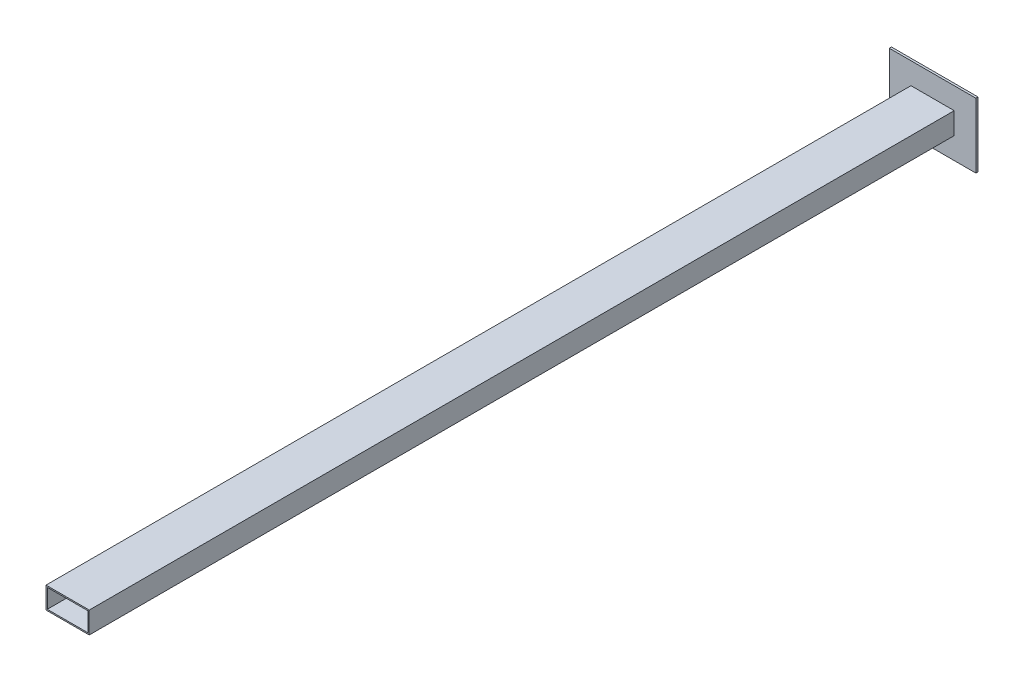
ISO-10303-21;
HEADER;
FILE_DESCRIPTION(('STEP AP214'),'2;1');
FILE_NAME('part.step','',(''),(''),'','','');
FILE_SCHEMA(('AUTOMOTIVE_DESIGN { 1 0 10303 214 1 1 1 1 }'));
ENDSEC;
DATA;
#1=APPLICATION_CONTEXT('core data for automotive mechanical design processes');
#2=APPLICATION_PROTOCOL_DEFINITION('international standard','automotive_design',2000,#1);
#3=PRODUCT_CONTEXT('',#1,'mechanical');
#4=PRODUCT('Part','Part','',(#3));
#5=PRODUCT_RELATED_PRODUCT_CATEGORY('part','',(#4));
#6=PRODUCT_DEFINITION_FORMATION('','',#4);
#7=PRODUCT_DEFINITION_CONTEXT('part definition',#1,'design');
#8=PRODUCT_DEFINITION('design','',#6,#7);
#9=PRODUCT_DEFINITION_SHAPE('','',#8);
#10=(LENGTH_UNIT() NAMED_UNIT(*) SI_UNIT(.MILLI.,.METRE.));
#11=(NAMED_UNIT(*) PLANE_ANGLE_UNIT() SI_UNIT($,.RADIAN.));
#12=(NAMED_UNIT(*) SI_UNIT($,.STERADIAN.) SOLID_ANGLE_UNIT());
#13=UNCERTAINTY_MEASURE_WITH_UNIT(LENGTH_MEASURE(1.E-05),#10,'distance_accuracy_value','');
#14=(GEOMETRIC_REPRESENTATION_CONTEXT(3) GLOBAL_UNCERTAINTY_ASSIGNED_CONTEXT((#13)) GLOBAL_UNIT_ASSIGNED_CONTEXT((#10,
#11,#12)) REPRESENTATION_CONTEXT('',''));
#15=CARTESIAN_POINT('',(0.,0.,0.));
#16=DIRECTION('',(0.,0.,1.));
#17=DIRECTION('',(1.,0.,0.));
#18=AXIS2_PLACEMENT_3D('',#15,#16,#17);
#19=CARTESIAN_POINT('',(0.,0.,0.));
#20=DIRECTION('',(0.,0.,1.));
#21=DIRECTION('',(1.,0.,0.));
#22=AXIS2_PLACEMENT_3D('',#19,#20,#21);
#23=PLANE('',#22);
#24=DIRECTION('',(0.,1.,0.));
#25=VECTOR('',#24,1.);
#26=CARTESIAN_POINT('',(-50.,-50.,0.));
#27=LINE('',#26,#25);
#28=CARTESIAN_POINT('',(-50.,-50.,0.));
#29=VERTEX_POINT('',#28);
#30=CARTESIAN_POINT('',(-50.,100.,0.));
#31=VERTEX_POINT('',#30);
#32=EDGE_CURVE('E130',#29,#31,#27,.T.);
#33=ORIENTED_EDGE('',*,*,#32,.F.);
#34=DIRECTION('',(-1.,0.,0.));
#35=VECTOR('',#34,1.);
#36=CARTESIAN_POINT('',(150.,-50.,0.));
#37=LINE('',#36,#35);
#38=CARTESIAN_POINT('',(150.,-50.,0.));
#39=VERTEX_POINT('',#38);
#40=EDGE_CURVE('E103',#39,#29,#37,.T.);
#41=ORIENTED_EDGE('',*,*,#40,.F.);
#42=DIRECTION('',(0.,-1.,0.));
#43=VECTOR('',#42,1.);
#44=CARTESIAN_POINT('',(150.,-50.,0.));
#45=LINE('',#44,#43);
#46=CARTESIAN_POINT('',(150.,100.,0.));
#47=VERTEX_POINT('',#46);
#48=EDGE_CURVE('E97',#47,#39,#45,.T.);
#49=ORIENTED_EDGE('',*,*,#48,.F.);
#50=DIRECTION('',(1.,0.,0.));
#51=VECTOR('',#50,1.);
#52=CARTESIAN_POINT('',(150.,100.,0.));
#53=LINE('',#52,#51);
#54=EDGE_CURVE('E119',#31,#47,#53,.T.);
#55=ORIENTED_EDGE('',*,*,#54,.F.);
#56=EDGE_LOOP('',(#33,#41,#49,#55));
#57=FACE_BOUND('',#56,.T.);
#58=ADVANCED_FACE('F59',(#57),#23,.T.);
#59=CARTESIAN_POINT('',(150.,100.,-5.));
#60=DIRECTION('',(0.,-1.,0.));
#61=DIRECTION('',(0.,0.,-1.));
#62=AXIS2_PLACEMENT_3D('',#59,#60,#61);
#63=PLANE('',#62);
#64=ORIENTED_EDGE('',*,*,#54,.T.);
#65=DIRECTION('',(0.,0.,1.));
#66=VECTOR('',#65,1.);
#67=CARTESIAN_POINT('',(150.,100.,-5.));
#68=LINE('',#67,#66);
#69=CARTESIAN_POINT('',(150.,100.,-5.));
#70=VERTEX_POINT('',#69);
#71=EDGE_CURVE('E68',#70,#47,#68,.T.);
#72=ORIENTED_EDGE('',*,*,#71,.F.);
#73=DIRECTION('',(1.,0.,0.));
#74=VECTOR('',#73,1.);
#75=CARTESIAN_POINT('',(150.,100.,-5.));
#76=LINE('',#75,#74);
#77=CARTESIAN_POINT('',(-50.,100.,-5.));
#78=VERTEX_POINT('',#77);
#79=EDGE_CURVE('E110',#78,#70,#76,.T.);
#80=ORIENTED_EDGE('',*,*,#79,.F.);
#81=DIRECTION('',(0.,0.,1.));
#82=VECTOR('',#81,1.);
#83=CARTESIAN_POINT('',(-50.,100.,-5.));
#84=LINE('',#83,#82);
#85=EDGE_CURVE('E12',#78,#31,#84,.T.);
#86=ORIENTED_EDGE('',*,*,#85,.T.);
#87=EDGE_LOOP('',(#64,#72,#80,#86));
#88=FACE_BOUND('',#87,.T.);
#89=ADVANCED_FACE('F118',(#88),#63,.F.);
#90=CARTESIAN_POINT('',(150.,-50.,-5.));
#91=DIRECTION('',(-1.,0.,0.));
#92=DIRECTION('',(0.,0.,1.));
#93=AXIS2_PLACEMENT_3D('',#90,#91,#92);
#94=PLANE('',#93);
#95=ORIENTED_EDGE('',*,*,#48,.T.);
#96=DIRECTION('',(0.,0.,1.));
#97=VECTOR('',#96,1.);
#98=CARTESIAN_POINT('',(150.,-50.,-5.));
#99=LINE('',#98,#97);
#100=CARTESIAN_POINT('',(150.,-50.,-5.));
#101=VERTEX_POINT('',#100);
#102=EDGE_CURVE('E120',#101,#39,#99,.T.);
#103=ORIENTED_EDGE('',*,*,#102,.F.);
#104=DIRECTION('',(0.,-1.,0.));
#105=VECTOR('',#104,1.);
#106=CARTESIAN_POINT('',(150.,-50.,-5.));
#107=LINE('',#106,#105);
#108=EDGE_CURVE('E113',#70,#101,#107,.T.);
#109=ORIENTED_EDGE('',*,*,#108,.F.);
#110=ORIENTED_EDGE('',*,*,#71,.T.);
#111=EDGE_LOOP('',(#95,#103,#109,#110));
#112=FACE_BOUND('',#111,.T.);
#113=ADVANCED_FACE('F121',(#112),#94,.F.);
#114=CARTESIAN_POINT('',(0.,0.,-5.));
#115=DIRECTION('',(0.,0.,1.));
#116=DIRECTION('',(1.,0.,0.));
#117=AXIS2_PLACEMENT_3D('',#114,#115,#116);
#118=PLANE('',#117);
#119=DIRECTION('',(0.,1.,0.));
#120=VECTOR('',#119,1.);
#121=CARTESIAN_POINT('',(-50.,-50.,-5.));
#122=LINE('',#121,#120);
#123=CARTESIAN_POINT('',(-50.,-50.,-5.));
#124=VERTEX_POINT('',#123);
#125=EDGE_CURVE('E115',#124,#78,#122,.T.);
#126=ORIENTED_EDGE('',*,*,#125,.T.);
#127=ORIENTED_EDGE('',*,*,#79,.T.);
#128=ORIENTED_EDGE('',*,*,#108,.T.);
#129=DIRECTION('',(-1.,0.,0.));
#130=VECTOR('',#129,1.);
#131=CARTESIAN_POINT('',(150.,-50.,-5.));
#132=LINE('',#131,#130);
#133=EDGE_CURVE('E79',#101,#124,#132,.T.);
#134=ORIENTED_EDGE('',*,*,#133,.T.);
#135=EDGE_LOOP('',(#126,#127,#128,#134));
#136=FACE_BOUND('',#135,.T.);
#137=ADVANCED_FACE('F111',(#136),#118,.F.);
#138=CARTESIAN_POINT('',(-50.,-50.,-5.));
#139=DIRECTION('',(1.,0.,0.));
#140=DIRECTION('',(0.,0.,-1.));
#141=AXIS2_PLACEMENT_3D('',#138,#139,#140);
#142=PLANE('',#141);
#143=ORIENTED_EDGE('',*,*,#32,.T.);
#144=ORIENTED_EDGE('',*,*,#85,.F.);
#145=ORIENTED_EDGE('',*,*,#125,.F.);
#146=DIRECTION('',(0.,0.,1.));
#147=VECTOR('',#146,1.);
#148=CARTESIAN_POINT('',(-50.,-50.,-5.));
#149=LINE('',#148,#147);
#150=EDGE_CURVE('E126',#124,#29,#149,.T.);
#151=ORIENTED_EDGE('',*,*,#150,.T.);
#152=EDGE_LOOP('',(#143,#144,#145,#151));
#153=FACE_BOUND('',#152,.T.);
#154=ADVANCED_FACE('F61',(#153),#142,.F.);
#155=CARTESIAN_POINT('',(150.,-50.,-5.));
#156=DIRECTION('',(0.,1.,0.));
#157=DIRECTION('',(0.,0.,1.));
#158=AXIS2_PLACEMENT_3D('',#155,#156,#157);
#159=PLANE('',#158);
#160=ORIENTED_EDGE('',*,*,#40,.T.);
#161=ORIENTED_EDGE('',*,*,#150,.F.);
#162=ORIENTED_EDGE('',*,*,#133,.F.);
#163=ORIENTED_EDGE('',*,*,#102,.T.);
#164=EDGE_LOOP('',(#160,#161,#162,#163));
#165=FACE_BOUND('',#164,.T.);
#166=ADVANCED_FACE('F142',(#165),#159,.F.);
#167=CLOSED_SHELL('',(#58,#89,#113,#137,#154,#166));
#168=MANIFOLD_SOLID_BREP('B2',#167);
#169=CARTESIAN_POINT('',(-60.2638018139481,100.01,0.));
#170=DIRECTION('',(0.,0.,-1.));
#171=DIRECTION('',(-1.,0.,0.));
#172=AXIS2_PLACEMENT_3D('',#169,#170,#171);
#173=PLANE('',#172);
#174=DIRECTION('',(1.,0.,0.));
#175=VECTOR('',#174,1.);
#176=CARTESIAN_POINT('',(3.,3.,0.));
#177=LINE('',#176,#175);
#178=CARTESIAN_POINT('',(3.,3.,0.));
#179=VERTEX_POINT('',#178);
#180=CARTESIAN_POINT('',(97.,3.,0.));
#181=VERTEX_POINT('',#180);
#182=EDGE_CURVE('E302',#179,#181,#177,.T.);
#183=ORIENTED_EDGE('',*,*,#182,.T.);
#184=DIRECTION('',(0.,1.,0.));
#185=VECTOR('',#184,1.);
#186=CARTESIAN_POINT('',(97.,3.,0.));
#187=LINE('',#186,#185);
#188=CARTESIAN_POINT('',(97.,47.,0.));
#189=VERTEX_POINT('',#188);
#190=EDGE_CURVE('E280',#181,#189,#187,.T.);
#191=ORIENTED_EDGE('',*,*,#190,.T.);
#192=DIRECTION('',(-1.,0.,0.));
#193=VECTOR('',#192,1.);
#194=CARTESIAN_POINT('',(3.,47.,0.));
#195=LINE('',#194,#193);
#196=CARTESIAN_POINT('',(3.,47.,0.));
#197=VERTEX_POINT('',#196);
#198=EDGE_CURVE('E291',#189,#197,#195,.T.);
#199=ORIENTED_EDGE('',*,*,#198,.T.);
#200=DIRECTION('',(0.,-1.,0.));
#201=VECTOR('',#200,1.);
#202=CARTESIAN_POINT('',(3.,3.,0.));
#203=LINE('',#202,#201);
#204=EDGE_CURVE('E203',#197,#179,#203,.T.);
#205=ORIENTED_EDGE('',*,*,#204,.T.);
#206=EDGE_LOOP('',(#183,#191,#199,#205));
#207=FACE_BOUND('',#206,.T.);
#208=DIRECTION('',(0.,-1.,0.));
#209=VECTOR('',#208,1.);
#210=CARTESIAN_POINT('',(0.,0.,0.));
#211=LINE('',#210,#209);
#212=CARTESIAN_POINT('',(0.,50.,0.));
#213=VERTEX_POINT('',#212);
#214=CARTESIAN_POINT('',(0.,0.,0.));
#215=VERTEX_POINT('',#214);
#216=EDGE_CURVE('E219',#213,#215,#211,.T.);
#217=ORIENTED_EDGE('',*,*,#216,.F.);
#218=DIRECTION('',(-1.,0.,0.));
#219=VECTOR('',#218,1.);
#220=CARTESIAN_POINT('',(0.,50.,0.));
#221=LINE('',#220,#219);
#222=CARTESIAN_POINT('',(100.,50.,0.));
#223=VERTEX_POINT('',#222);
#224=EDGE_CURVE('E307',#223,#213,#221,.T.);
#225=ORIENTED_EDGE('',*,*,#224,.F.);
#226=DIRECTION('',(0.,1.,0.));
#227=VECTOR('',#226,1.);
#228=CARTESIAN_POINT('',(100.,0.,0.));
#229=LINE('',#228,#227);
#230=CARTESIAN_POINT('',(100.,0.,0.));
#231=VERTEX_POINT('',#230);
#232=EDGE_CURVE('E229',#231,#223,#229,.T.);
#233=ORIENTED_EDGE('',*,*,#232,.F.);
#234=DIRECTION('',(1.,0.,0.));
#235=VECTOR('',#234,1.);
#236=CARTESIAN_POINT('',(0.,0.,0.));
#237=LINE('',#236,#235);
#238=EDGE_CURVE('E314',#215,#231,#237,.T.);
#239=ORIENTED_EDGE('',*,*,#238,.F.);
#240=EDGE_LOOP('',(#217,#225,#233,#239));
#241=FACE_BOUND('',#240,.T.);
#242=ADVANCED_FACE('F200',(#207,#241),#173,.T.);
#243=CARTESIAN_POINT('',(3.,47.,2000.));
#244=DIRECTION('',(0.,-1.,0.));
#245=DIRECTION('',(0.,0.,-1.));
#246=AXIS2_PLACEMENT_3D('',#243,#244,#245);
#247=PLANE('',#246);
#248=ORIENTED_EDGE('',*,*,#198,.F.);
#249=DIRECTION('',(0.,0.,-1.));
#250=VECTOR('',#249,1.);
#251=CARTESIAN_POINT('',(97.,47.,2000.));
#252=LINE('',#251,#250);
#253=CARTESIAN_POINT('',(97.,47.,2000.));
#254=VERTEX_POINT('',#253);
#255=EDGE_CURVE('E275',#254,#189,#252,.T.);
#256=ORIENTED_EDGE('',*,*,#255,.F.);
#257=DIRECTION('',(-1.,0.,0.));
#258=VECTOR('',#257,1.);
#259=CARTESIAN_POINT('',(3.,47.,2000.));
#260=LINE('',#259,#258);
#261=CARTESIAN_POINT('',(3.,47.,2000.));
#262=VERTEX_POINT('',#261);
#263=EDGE_CURVE('E324',#254,#262,#260,.T.);
#264=ORIENTED_EDGE('',*,*,#263,.T.);
#265=DIRECTION('',(0.,0.,-1.));
#266=VECTOR('',#265,1.);
#267=CARTESIAN_POINT('',(3.,47.,2000.));
#268=LINE('',#267,#266);
#269=EDGE_CURVE('E287',#262,#197,#268,.T.);
#270=ORIENTED_EDGE('',*,*,#269,.T.);
#271=EDGE_LOOP('',(#248,#256,#264,#270));
#272=FACE_BOUND('',#271,.T.);
#273=ADVANCED_FACE('F292',(#272),#247,.T.);
#274=CARTESIAN_POINT('',(97.,3.,2000.));
#275=DIRECTION('',(-1.,0.,0.));
#276=DIRECTION('',(0.,0.,1.));
#277=AXIS2_PLACEMENT_3D('',#274,#275,#276);
#278=PLANE('',#277);
#279=ORIENTED_EDGE('',*,*,#190,.F.);
#280=DIRECTION('',(0.,0.,-1.));
#281=VECTOR('',#280,1.);
#282=CARTESIAN_POINT('',(97.,3.,2000.));
#283=LINE('',#282,#281);
#284=CARTESIAN_POINT('',(97.,3.,2000.));
#285=VERTEX_POINT('',#284);
#286=EDGE_CURVE('E288',#285,#181,#283,.T.);
#287=ORIENTED_EDGE('',*,*,#286,.F.);
#288=DIRECTION('',(0.,1.,0.));
#289=VECTOR('',#288,1.);
#290=CARTESIAN_POINT('',(97.,3.,2000.));
#291=LINE('',#290,#289);
#292=EDGE_CURVE('E283',#285,#254,#291,.T.);
#293=ORIENTED_EDGE('',*,*,#292,.T.);
#294=ORIENTED_EDGE('',*,*,#255,.T.);
#295=EDGE_LOOP('',(#279,#287,#293,#294));
#296=FACE_BOUND('',#295,.T.);
#297=ADVANCED_FACE('F277',(#296),#278,.T.);
#298=CARTESIAN_POINT('',(0.,50.,2000.));
#299=DIRECTION('',(0.,-1.,0.));
#300=DIRECTION('',(0.,0.,-1.));
#301=AXIS2_PLACEMENT_3D('',#298,#299,#300);
#302=PLANE('',#301);
#303=ORIENTED_EDGE('',*,*,#224,.T.);
#304=DIRECTION('',(0.,0.,-1.));
#305=VECTOR('',#304,1.);
#306=CARTESIAN_POINT('',(0.,50.,2000.));
#307=LINE('',#306,#305);
#308=CARTESIAN_POINT('',(0.,50.,2000.));
#309=VERTEX_POINT('',#308);
#310=EDGE_CURVE('E345',#309,#213,#307,.T.);
#311=ORIENTED_EDGE('',*,*,#310,.F.);
#312=DIRECTION('',(-1.,0.,0.));
#313=VECTOR('',#312,1.);
#314=CARTESIAN_POINT('',(0.,50.,2000.));
#315=LINE('',#314,#313);
#316=CARTESIAN_POINT('',(100.,50.,2000.));
#317=VERTEX_POINT('',#316);
#318=EDGE_CURVE('E342',#317,#309,#315,.T.);
#319=ORIENTED_EDGE('',*,*,#318,.F.);
#320=DIRECTION('',(0.,0.,-1.));
#321=VECTOR('',#320,1.);
#322=CARTESIAN_POINT('',(100.,50.,2000.));
#323=LINE('',#322,#321);
#324=EDGE_CURVE('E348',#317,#223,#323,.T.);
#325=ORIENTED_EDGE('',*,*,#324,.T.);
#326=EDGE_LOOP('',(#303,#311,#319,#325));
#327=FACE_BOUND('',#326,.T.);
#328=ADVANCED_FACE('F369',(#327),#302,.F.);
#329=CARTESIAN_POINT('',(0.,0.,2000.));
#330=DIRECTION('',(1.,0.,0.));
#331=DIRECTION('',(0.,0.,-1.));
#332=AXIS2_PLACEMENT_3D('',#329,#330,#331);
#333=PLANE('',#332);
#334=ORIENTED_EDGE('',*,*,#216,.T.);
#335=DIRECTION('',(0.,0.,-1.));
#336=VECTOR('',#335,1.);
#337=CARTESIAN_POINT('',(0.,0.,2000.));
#338=LINE('',#337,#336);
#339=CARTESIAN_POINT('',(0.,0.,2000.));
#340=VERTEX_POINT('',#339);
#341=EDGE_CURVE('E298',#340,#215,#338,.T.);
#342=ORIENTED_EDGE('',*,*,#341,.F.);
#343=DIRECTION('',(0.,-1.,0.));
#344=VECTOR('',#343,1.);
#345=CARTESIAN_POINT('',(0.,0.,2000.));
#346=LINE('',#345,#344);
#347=EDGE_CURVE('E311',#309,#340,#346,.T.);
#348=ORIENTED_EDGE('',*,*,#347,.F.);
#349=ORIENTED_EDGE('',*,*,#310,.T.);
#350=EDGE_LOOP('',(#334,#342,#348,#349));
#351=FACE_BOUND('',#350,.T.);
#352=ADVANCED_FACE('F361',(#351),#333,.F.);
#353=CARTESIAN_POINT('',(0.,0.,2000.));
#354=DIRECTION('',(0.,0.,-1.));
#355=DIRECTION('',(-1.,0.,0.));
#356=AXIS2_PLACEMENT_3D('',#353,#354,#355);
#357=PLANE('',#356);
#358=ORIENTED_EDGE('',*,*,#347,.T.);
#359=DIRECTION('',(1.,0.,0.));
#360=VECTOR('',#359,1.);
#361=CARTESIAN_POINT('',(0.,0.,2000.));
#362=LINE('',#361,#360);
#363=CARTESIAN_POINT('',(100.,0.,2000.));
#364=VERTEX_POINT('',#363);
#365=EDGE_CURVE('E336',#340,#364,#362,.T.);
#366=ORIENTED_EDGE('',*,*,#365,.T.);
#367=DIRECTION('',(0.,1.,0.));
#368=VECTOR('',#367,1.);
#369=CARTESIAN_POINT('',(100.,0.,2000.));
#370=LINE('',#369,#368);
#371=EDGE_CURVE('E339',#364,#317,#370,.T.);
#372=ORIENTED_EDGE('',*,*,#371,.T.);
#373=ORIENTED_EDGE('',*,*,#318,.T.);
#374=EDGE_LOOP('',(#358,#366,#372,#373));
#375=FACE_BOUND('',#374,.T.);
#376=DIRECTION('',(0.,-1.,0.));
#377=VECTOR('',#376,1.);
#378=CARTESIAN_POINT('',(3.,3.,2000.));
#379=LINE('',#378,#377);
#380=CARTESIAN_POINT('',(3.,3.,2000.));
#381=VERTEX_POINT('',#380);
#382=EDGE_CURVE('E57',#262,#381,#379,.T.);
#383=ORIENTED_EDGE('',*,*,#382,.F.);
#384=ORIENTED_EDGE('',*,*,#263,.F.);
#385=ORIENTED_EDGE('',*,*,#292,.F.);
#386=DIRECTION('',(1.,0.,0.));
#387=VECTOR('',#386,1.);
#388=CARTESIAN_POINT('',(3.,3.,2000.));
#389=LINE('',#388,#387);
#390=EDGE_CURVE('E209',#381,#285,#389,.T.);
#391=ORIENTED_EDGE('',*,*,#390,.F.);
#392=EDGE_LOOP('',(#383,#384,#385,#391));
#393=FACE_BOUND('',#392,.T.);
#394=ADVANCED_FACE('F364',(#375,#393),#357,.F.);
#395=CARTESIAN_POINT('',(100.,0.,2000.));
#396=DIRECTION('',(-1.,0.,0.));
#397=DIRECTION('',(0.,0.,1.));
#398=AXIS2_PLACEMENT_3D('',#395,#396,#397);
#399=PLANE('',#398);
#400=ORIENTED_EDGE('',*,*,#232,.T.);
#401=ORIENTED_EDGE('',*,*,#324,.F.);
#402=ORIENTED_EDGE('',*,*,#371,.F.);
#403=DIRECTION('',(0.,0.,-1.));
#404=VECTOR('',#403,1.);
#405=CARTESIAN_POINT('',(100.,0.,2000.));
#406=LINE('',#405,#404);
#407=EDGE_CURVE('E352',#364,#231,#406,.T.);
#408=ORIENTED_EDGE('',*,*,#407,.T.);
#409=EDGE_LOOP('',(#400,#401,#402,#408));
#410=FACE_BOUND('',#409,.T.);
#411=ADVANCED_FACE('F370',(#410),#399,.F.);
#412=CARTESIAN_POINT('',(0.,0.,2000.));
#413=DIRECTION('',(0.,1.,0.));
#414=DIRECTION('',(0.,0.,1.));
#415=AXIS2_PLACEMENT_3D('',#412,#413,#414);
#416=PLANE('',#415);
#417=ORIENTED_EDGE('',*,*,#238,.T.);
#418=ORIENTED_EDGE('',*,*,#407,.F.);
#419=ORIENTED_EDGE('',*,*,#365,.F.);
#420=ORIENTED_EDGE('',*,*,#341,.T.);
#421=EDGE_LOOP('',(#417,#418,#419,#420));
#422=FACE_BOUND('',#421,.T.);
#423=ADVANCED_FACE('F358',(#422),#416,.F.);
#424=CARTESIAN_POINT('',(3.,3.,2000.));
#425=DIRECTION('',(1.,0.,0.));
#426=DIRECTION('',(0.,0.,-1.));
#427=AXIS2_PLACEMENT_3D('',#424,#425,#426);
#428=PLANE('',#427);
#429=ORIENTED_EDGE('',*,*,#204,.F.);
#430=ORIENTED_EDGE('',*,*,#269,.F.);
#431=ORIENTED_EDGE('',*,*,#382,.T.);
#432=DIRECTION('',(0.,0.,-1.));
#433=VECTOR('',#432,1.);
#434=CARTESIAN_POINT('',(3.,3.,2000.));
#435=LINE('',#434,#433);
#436=EDGE_CURVE('E318',#381,#179,#435,.T.);
#437=ORIENTED_EDGE('',*,*,#436,.T.);
#438=EDGE_LOOP('',(#429,#430,#431,#437));
#439=FACE_BOUND('',#438,.T.);
#440=ADVANCED_FACE('F377',(#439),#428,.T.);
#441=CARTESIAN_POINT('',(3.,3.,2000.));
#442=DIRECTION('',(0.,1.,0.));
#443=DIRECTION('',(0.,0.,1.));
#444=AXIS2_PLACEMENT_3D('',#441,#442,#443);
#445=PLANE('',#444);
#446=ORIENTED_EDGE('',*,*,#182,.F.);
#447=ORIENTED_EDGE('',*,*,#436,.F.);
#448=ORIENTED_EDGE('',*,*,#390,.T.);
#449=ORIENTED_EDGE('',*,*,#286,.T.);
#450=EDGE_LOOP('',(#446,#447,#448,#449));
#451=FACE_BOUND('',#450,.T.);
#452=ADVANCED_FACE('F387',(#451),#445,.T.);
#453=CLOSED_SHELL('',(#242,#273,#297,#328,#352,#394,#411,#423,#440,#452));
#454=MANIFOLD_SOLID_BREP('B6',#453);
#455=ADVANCED_BREP_SHAPE_REPRESENTATION('',(#18,#168,#454),#14);
#456=SHAPE_DEFINITION_REPRESENTATION(#9,#455);
ENDSEC;
END-ISO-10303-21;
